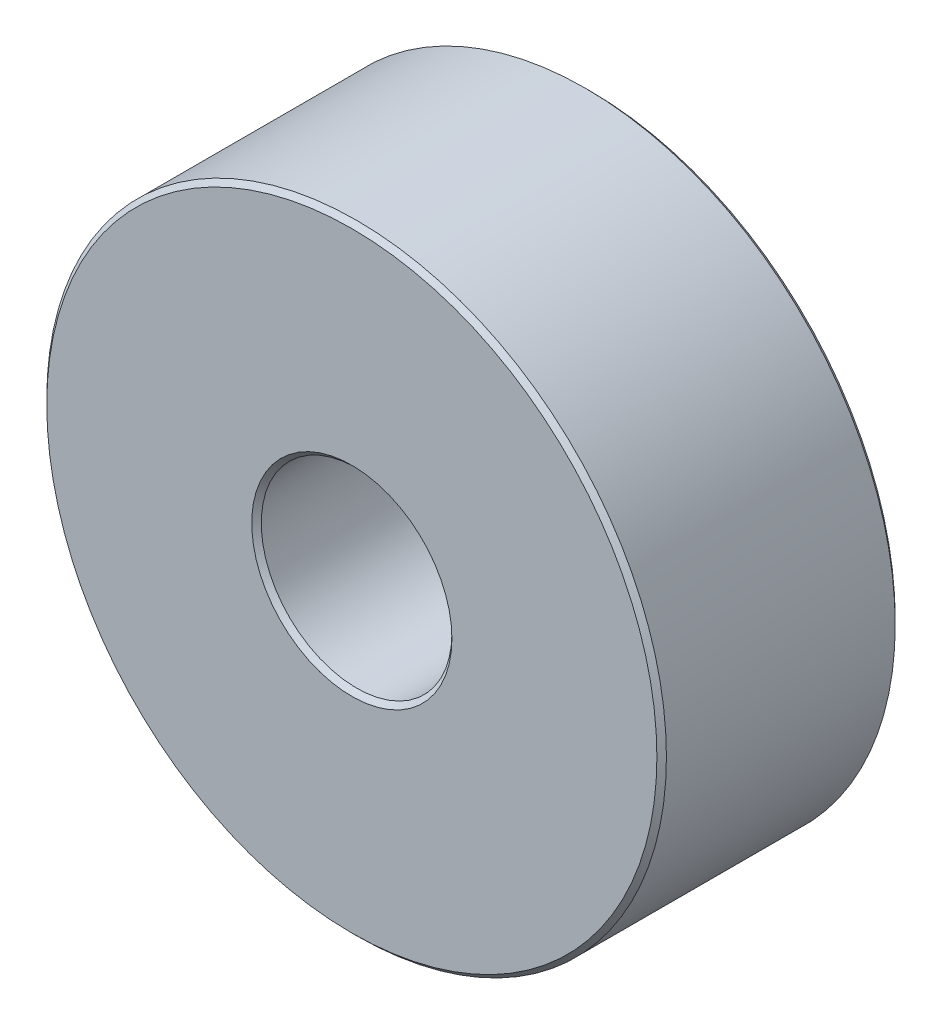
ISO-10303-21;
HEADER;
FILE_DESCRIPTION(('STEP AP214'),'2;1');
FILE_NAME('part.step','',(''),(''),'','','');
FILE_SCHEMA(('AUTOMOTIVE_DESIGN { 1 0 10303 214 1 1 1 1 }'));
ENDSEC;
DATA;
#1=APPLICATION_CONTEXT('core data for automotive mechanical design processes');
#2=APPLICATION_PROTOCOL_DEFINITION('international standard','automotive_design',2000,#1);
#3=PRODUCT_CONTEXT('',#1,'mechanical');
#4=PRODUCT('Part','Part','',(#3));
#5=PRODUCT_RELATED_PRODUCT_CATEGORY('part','',(#4));
#6=PRODUCT_DEFINITION_FORMATION('','',#4);
#7=PRODUCT_DEFINITION_CONTEXT('part definition',#1,'design');
#8=PRODUCT_DEFINITION('design','',#6,#7);
#9=PRODUCT_DEFINITION_SHAPE('','',#8);
#10=(LENGTH_UNIT() NAMED_UNIT(*) SI_UNIT(.MILLI.,.METRE.));
#11=(NAMED_UNIT(*) PLANE_ANGLE_UNIT() SI_UNIT($,.RADIAN.));
#12=(NAMED_UNIT(*) SI_UNIT($,.STERADIAN.) SOLID_ANGLE_UNIT());
#13=UNCERTAINTY_MEASURE_WITH_UNIT(LENGTH_MEASURE(1.E-05),#10,'distance_accuracy_value','');
#14=(GEOMETRIC_REPRESENTATION_CONTEXT(3) GLOBAL_UNCERTAINTY_ASSIGNED_CONTEXT((#13)) GLOBAL_UNIT_ASSIGNED_CONTEXT((#10,
#11,#12)) REPRESENTATION_CONTEXT('',''));
#15=CARTESIAN_POINT('',(0.,0.,0.));
#16=DIRECTION('',(0.,0.,1.));
#17=DIRECTION('',(1.,0.,0.));
#18=AXIS2_PLACEMENT_3D('',#15,#16,#17);
#19=CARTESIAN_POINT('',(0.,0.,2.5));
#20=DIRECTION('',(0.,0.,1.));
#21=DIRECTION('',(1.,0.,0.));
#22=AXIS2_PLACEMENT_3D('',#19,#20,#21);
#23=PLANE('',#22);
#24=CARTESIAN_POINT('',(0.,0.,2.5));
#25=DIRECTION('',(0.,0.,1.));
#26=DIRECTION('',(1.,0.,0.));
#27=AXIS2_PLACEMENT_3D('',#24,#25,#26);
#28=CIRCLE('',#27,6.4);
#29=CARTESIAN_POINT('',(6.4,0.,2.5));
#30=VERTEX_POINT('',#29);
#31=EDGE_CURVE('E10',#30,#30,#28,.T.);
#32=ORIENTED_EDGE('',*,*,#31,.T.);
#33=EDGE_LOOP('',(#32));
#34=FACE_BOUND('',#33,.T.);
#35=CARTESIAN_POINT('',(0.,0.,2.5));
#36=DIRECTION('',(0.,0.,1.));
#37=DIRECTION('',(1.,0.,0.));
#38=AXIS2_PLACEMENT_3D('',#35,#36,#37);
#39=CIRCLE('',#38,2.1);
#40=CARTESIAN_POINT('',(2.1,0.,2.5));
#41=VERTEX_POINT('',#40);
#42=EDGE_CURVE('E43',#41,#41,#39,.F.);
#43=ORIENTED_EDGE('',*,*,#42,.T.);
#44=EDGE_LOOP('',(#43));
#45=FACE_BOUND('',#44,.T.);
#46=ADVANCED_FACE('F35',(#34,#45),#23,.T.);
#47=CARTESIAN_POINT('',(0.,0.,-2.5));
#48=DIRECTION('',(0.,0.,1.));
#49=DIRECTION('',(1.,0.,0.));
#50=AXIS2_PLACEMENT_3D('',#47,#48,#49);
#51=PLANE('',#50);
#52=CARTESIAN_POINT('',(0.,0.,-2.5));
#53=DIRECTION('',(0.,0.,1.));
#54=DIRECTION('',(1.,0.,0.));
#55=AXIS2_PLACEMENT_3D('',#52,#53,#54);
#56=CIRCLE('',#55,6.4);
#57=CARTESIAN_POINT('',(6.4,0.,-2.5));
#58=VERTEX_POINT('',#57);
#59=EDGE_CURVE('E56',#58,#58,#56,.F.);
#60=ORIENTED_EDGE('',*,*,#59,.T.);
#61=EDGE_LOOP('',(#60));
#62=FACE_BOUND('',#61,.T.);
#63=CARTESIAN_POINT('',(0.,0.,-2.5));
#64=DIRECTION('',(0.,0.,1.));
#65=DIRECTION('',(1.,0.,0.));
#66=AXIS2_PLACEMENT_3D('',#63,#64,#65);
#67=CIRCLE('',#66,2.1);
#68=CARTESIAN_POINT('',(2.1,0.,-2.5));
#69=VERTEX_POINT('',#68);
#70=EDGE_CURVE('E59',#69,#69,#67,.T.);
#71=ORIENTED_EDGE('',*,*,#70,.T.);
#72=EDGE_LOOP('',(#71));
#73=FACE_BOUND('',#72,.T.);
#74=ADVANCED_FACE('F85',(#62,#73),#51,.F.);
#75=CARTESIAN_POINT('',(0.,0.,2.5));
#76=DIRECTION('',(0.,0.,-1.));
#77=DIRECTION('',(-1.,0.,0.));
#78=AXIS2_PLACEMENT_3D('',#75,#76,#77);
#79=CYLINDRICAL_SURFACE('',#78,6.5);
#80=CARTESIAN_POINT('',(0.,0.,-2.4));
#81=DIRECTION('',(0.,0.,1.));
#82=DIRECTION('',(1.,0.,0.));
#83=AXIS2_PLACEMENT_3D('',#80,#81,#82);
#84=CIRCLE('',#83,6.5);
#85=CARTESIAN_POINT('',(6.5,0.,-2.4));
#86=VERTEX_POINT('',#85);
#87=EDGE_CURVE('E62',#86,#86,#84,.T.);
#88=ORIENTED_EDGE('',*,*,#87,.T.);
#89=EDGE_LOOP('',(#88));
#90=FACE_BOUND('',#89,.T.);
#91=CARTESIAN_POINT('',(0.,0.,2.39999999999999));
#92=DIRECTION('',(0.,0.,1.));
#93=DIRECTION('',(1.,0.,0.));
#94=AXIS2_PLACEMENT_3D('',#91,#92,#93);
#95=CIRCLE('',#94,6.5);
#96=CARTESIAN_POINT('',(6.5,0.,2.39999999999999));
#97=VERTEX_POINT('',#96);
#98=EDGE_CURVE('E65',#97,#97,#95,.F.);
#99=ORIENTED_EDGE('',*,*,#98,.T.);
#100=EDGE_LOOP('',(#99));
#101=FACE_BOUND('',#100,.T.);
#102=ADVANCED_FACE('F69',(#90,#101),#79,.T.);
#103=CARTESIAN_POINT('',(0.,0.,2.5));
#104=DIRECTION('',(0.,0.,-1.));
#105=DIRECTION('',(-1.,0.,0.));
#106=AXIS2_PLACEMENT_3D('',#103,#104,#105);
#107=CYLINDRICAL_SURFACE('',#106,2.);
#108=CARTESIAN_POINT('',(0.,0.,-2.4));
#109=DIRECTION('',(0.,0.,1.));
#110=DIRECTION('',(1.,0.,0.));
#111=AXIS2_PLACEMENT_3D('',#108,#109,#110);
#112=CIRCLE('',#111,2.);
#113=CARTESIAN_POINT('',(2.,0.,-2.4));
#114=VERTEX_POINT('',#113);
#115=EDGE_CURVE('E47',#114,#114,#112,.F.);
#116=ORIENTED_EDGE('',*,*,#115,.T.);
#117=EDGE_LOOP('',(#116));
#118=FACE_BOUND('',#117,.T.);
#119=CARTESIAN_POINT('',(0.,0.,2.4));
#120=DIRECTION('',(0.,0.,1.));
#121=DIRECTION('',(1.,0.,0.));
#122=AXIS2_PLACEMENT_3D('',#119,#120,#121);
#123=CIRCLE('',#122,2.);
#124=CARTESIAN_POINT('',(2.,0.,2.4));
#125=VERTEX_POINT('',#124);
#126=EDGE_CURVE('E51',#125,#125,#123,.T.);
#127=ORIENTED_EDGE('',*,*,#126,.T.);
#128=EDGE_LOOP('',(#127));
#129=FACE_BOUND('',#128,.T.);
#130=ADVANCED_FACE('F93',(#118,#129),#107,.F.);
#131=CARTESIAN_POINT('',(0.,0.,-2.4));
#132=DIRECTION('',(0.,0.,1.));
#133=DIRECTION('',(1.,0.,0.));
#134=AXIS2_PLACEMENT_3D('',#131,#132,#133);
#135=CONICAL_SURFACE('',#134,6.5,0.785398163397461);
#136=ORIENTED_EDGE('',*,*,#59,.F.);
#137=EDGE_LOOP('',(#136));
#138=FACE_BOUND('',#137,.T.);
#139=ORIENTED_EDGE('',*,*,#87,.F.);
#140=EDGE_LOOP('',(#139));
#141=FACE_BOUND('',#140,.T.);
#142=ADVANCED_FACE('F80',(#138,#141),#135,.T.);
#143=CARTESIAN_POINT('',(0.,0.,-2.5));
#144=DIRECTION('',(0.,0.,-1.));
#145=DIRECTION('',(-1.,0.,0.));
#146=AXIS2_PLACEMENT_3D('',#143,#144,#145);
#147=CONICAL_SURFACE('',#146,2.1,0.78539816339744);
#148=ORIENTED_EDGE('',*,*,#115,.F.);
#149=EDGE_LOOP('',(#148));
#150=FACE_BOUND('',#149,.T.);
#151=ORIENTED_EDGE('',*,*,#70,.F.);
#152=EDGE_LOOP('',(#151));
#153=FACE_BOUND('',#152,.T.);
#154=ADVANCED_FACE('F74',(#150,#153),#147,.F.);
#155=CARTESIAN_POINT('',(0.,0.,2.5));
#156=DIRECTION('',(0.,0.,-1.));
#157=DIRECTION('',(-1.,0.,0.));
#158=AXIS2_PLACEMENT_3D('',#155,#156,#157);
#159=CONICAL_SURFACE('',#158,6.4,0.785398163397444);
#160=ORIENTED_EDGE('',*,*,#98,.F.);
#161=EDGE_LOOP('',(#160));
#162=FACE_BOUND('',#161,.T.);
#163=ORIENTED_EDGE('',*,*,#31,.F.);
#164=EDGE_LOOP('',(#163));
#165=FACE_BOUND('',#164,.T.);
#166=ADVANCED_FACE('F71',(#162,#165),#159,.T.);
#167=CARTESIAN_POINT('',(0.,0.,2.4));
#168=DIRECTION('',(0.,0.,1.));
#169=DIRECTION('',(1.,0.,0.));
#170=AXIS2_PLACEMENT_3D('',#167,#168,#169);
#171=CONICAL_SURFACE('',#170,2.,0.785398163397455);
#172=ORIENTED_EDGE('',*,*,#42,.F.);
#173=EDGE_LOOP('',(#172));
#174=FACE_BOUND('',#173,.T.);
#175=ORIENTED_EDGE('',*,*,#126,.F.);
#176=EDGE_LOOP('',(#175));
#177=FACE_BOUND('',#176,.T.);
#178=ADVANCED_FACE('F38',(#174,#177),#171,.F.);
#179=CLOSED_SHELL('',(#46,#74,#102,#130,#142,#154,#166,#178));
#180=MANIFOLD_SOLID_BREP('B2',#179);
#181=ADVANCED_BREP_SHAPE_REPRESENTATION('',(#18,#180),#14);
#182=SHAPE_DEFINITION_REPRESENTATION(#9,#181);
ENDSEC;
END-ISO-10303-21;
